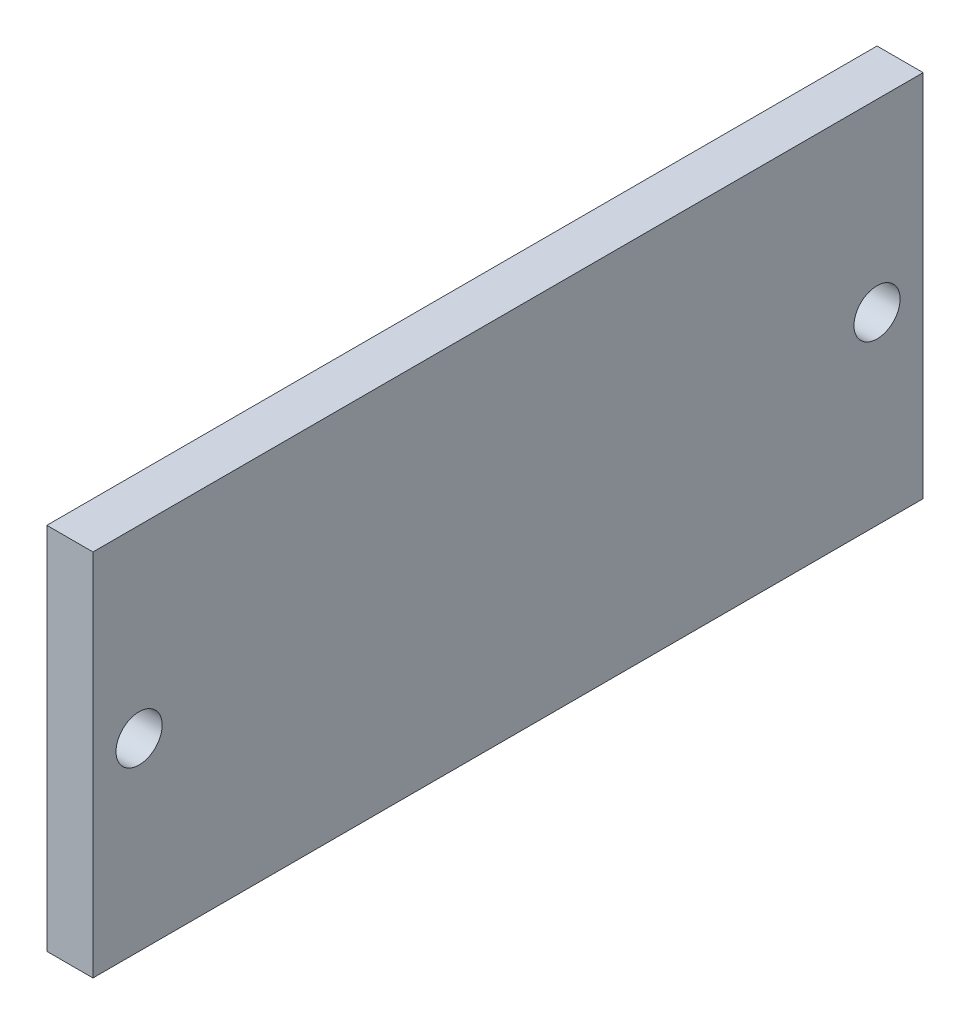
ISO-10303-21;
HEADER;
FILE_DESCRIPTION(('STEP AP214'),'2;1');
FILE_NAME('part.step','',(''),(''),'','','');
FILE_SCHEMA(('AUTOMOTIVE_DESIGN { 1 0 10303 214 1 1 1 1 }'));
ENDSEC;
DATA;
#1=APPLICATION_CONTEXT('core data for automotive mechanical design processes');
#2=APPLICATION_PROTOCOL_DEFINITION('international standard','automotive_design',2000,#1);
#3=PRODUCT_CONTEXT('',#1,'mechanical');
#4=PRODUCT('Part','Part','',(#3));
#5=PRODUCT_RELATED_PRODUCT_CATEGORY('part','',(#4));
#6=PRODUCT_DEFINITION_FORMATION('','',#4);
#7=PRODUCT_DEFINITION_CONTEXT('part definition',#1,'design');
#8=PRODUCT_DEFINITION('design','',#6,#7);
#9=PRODUCT_DEFINITION_SHAPE('','',#8);
#10=(LENGTH_UNIT() NAMED_UNIT(*) SI_UNIT(.MILLI.,.METRE.));
#11=(NAMED_UNIT(*) PLANE_ANGLE_UNIT() SI_UNIT($,.RADIAN.));
#12=(NAMED_UNIT(*) SI_UNIT($,.STERADIAN.) SOLID_ANGLE_UNIT());
#13=UNCERTAINTY_MEASURE_WITH_UNIT(LENGTH_MEASURE(1.E-05),#10,'distance_accuracy_value','');
#14=(GEOMETRIC_REPRESENTATION_CONTEXT(3) GLOBAL_UNCERTAINTY_ASSIGNED_CONTEXT((#13)) GLOBAL_UNIT_ASSIGNED_CONTEXT((#10,
#11,#12)) REPRESENTATION_CONTEXT('',''));
#15=CARTESIAN_POINT('',(0.,0.,0.));
#16=DIRECTION('',(0.,0.,1.));
#17=DIRECTION('',(1.,0.,0.));
#18=AXIS2_PLACEMENT_3D('',#15,#16,#17);
#19=CARTESIAN_POINT('',(12.7,0.,0.));
#20=DIRECTION('',(0.,0.,-1.));
#21=DIRECTION('',(0.,1.,0.));
#22=AXIS2_PLACEMENT_3D('',#19,#20,#21);
#23=PLANE('',#22);
#24=DIRECTION('',(0.,-1.,0.));
#25=VECTOR('',#24,1.);
#26=CARTESIAN_POINT('',(-12.7,0.,0.));
#27=LINE('',#26,#25);
#28=CARTESIAN_POINT('',(-12.7,203.2,1.11022302462516E-13));
#29=VERTEX_POINT('',#28);
#30=CARTESIAN_POINT('',(-12.7,0.,0.));
#31=VERTEX_POINT('',#30);
#32=EDGE_CURVE('E105',#29,#31,#27,.T.);
#33=ORIENTED_EDGE('',*,*,#32,.T.);
#34=DIRECTION('',(-1.,0.,0.));
#35=VECTOR('',#34,1.);
#36=CARTESIAN_POINT('',(12.7,0.,0.));
#37=LINE('',#36,#35);
#38=CARTESIAN_POINT('',(12.7,0.,0.));
#39=VERTEX_POINT('',#38);
#40=EDGE_CURVE('E11',#39,#31,#37,.T.);
#41=ORIENTED_EDGE('',*,*,#40,.F.);
#42=DIRECTION('',(0.,-1.,0.));
#43=VECTOR('',#42,1.);
#44=CARTESIAN_POINT('',(12.7,0.,0.));
#45=LINE('',#44,#43);
#46=CARTESIAN_POINT('',(12.7,203.2,1.11022302462516E-13));
#47=VERTEX_POINT('',#46);
#48=EDGE_CURVE('E92',#47,#39,#45,.T.);
#49=ORIENTED_EDGE('',*,*,#48,.F.);
#50=DIRECTION('',(-1.,0.,0.));
#51=VECTOR('',#50,1.);
#52=CARTESIAN_POINT('',(12.7,203.2,1.11022302462516E-13));
#53=LINE('',#52,#51);
#54=EDGE_CURVE('E101',#47,#29,#53,.T.);
#55=ORIENTED_EDGE('',*,*,#54,.T.);
#56=EDGE_LOOP('',(#33,#41,#49,#55));
#57=FACE_BOUND('',#56,.T.);
#58=ADVANCED_FACE('F39',(#57),#23,.F.);
#59=CARTESIAN_POINT('',(12.7,0.,0.));
#60=DIRECTION('',(0.,1.,0.));
#61=DIRECTION('',(0.,0.,1.));
#62=AXIS2_PLACEMENT_3D('',#59,#60,#61);
#63=PLANE('',#62);
#64=DIRECTION('',(0.,0.,-1.));
#65=VECTOR('',#64,1.);
#66=CARTESIAN_POINT('',(-12.7,0.,0.));
#67=LINE('',#66,#65);
#68=CARTESIAN_POINT('',(-12.7,0.,-457.2));
#69=VERTEX_POINT('',#68);
#70=EDGE_CURVE('E96',#31,#69,#67,.T.);
#71=ORIENTED_EDGE('',*,*,#70,.T.);
#72=DIRECTION('',(-1.,0.,0.));
#73=VECTOR('',#72,1.);
#74=CARTESIAN_POINT('',(12.7,0.,-457.2));
#75=LINE('',#74,#73);
#76=CARTESIAN_POINT('',(12.7,0.,-457.2));
#77=VERTEX_POINT('',#76);
#78=EDGE_CURVE('E48',#77,#69,#75,.T.);
#79=ORIENTED_EDGE('',*,*,#78,.F.);
#80=DIRECTION('',(0.,0.,-1.));
#81=VECTOR('',#80,1.);
#82=CARTESIAN_POINT('',(12.7,0.,0.));
#83=LINE('',#82,#81);
#84=EDGE_CURVE('E87',#39,#77,#83,.T.);
#85=ORIENTED_EDGE('',*,*,#84,.F.);
#86=ORIENTED_EDGE('',*,*,#40,.T.);
#87=EDGE_LOOP('',(#71,#79,#85,#86));
#88=FACE_BOUND('',#87,.T.);
#89=ADVANCED_FACE('F95',(#88),#63,.F.);
#90=CARTESIAN_POINT('',(12.7,0.,-457.2));
#91=DIRECTION('',(0.,0.,1.));
#92=DIRECTION('',(1.,0.,0.));
#93=AXIS2_PLACEMENT_3D('',#90,#91,#92);
#94=PLANE('',#93);
#95=DIRECTION('',(0.,1.,0.));
#96=VECTOR('',#95,1.);
#97=CARTESIAN_POINT('',(-12.7,0.,-457.2));
#98=LINE('',#97,#96);
#99=CARTESIAN_POINT('',(-12.7,203.2,-457.2));
#100=VERTEX_POINT('',#99);
#101=EDGE_CURVE('E74',#69,#100,#98,.T.);
#102=ORIENTED_EDGE('',*,*,#101,.T.);
#103=DIRECTION('',(-1.,0.,0.));
#104=VECTOR('',#103,1.);
#105=CARTESIAN_POINT('',(12.7,203.2,-457.2));
#106=LINE('',#105,#104);
#107=CARTESIAN_POINT('',(12.7,203.2,-457.2));
#108=VERTEX_POINT('',#107);
#109=EDGE_CURVE('E97',#108,#100,#106,.T.);
#110=ORIENTED_EDGE('',*,*,#109,.F.);
#111=DIRECTION('',(0.,1.,0.));
#112=VECTOR('',#111,1.);
#113=CARTESIAN_POINT('',(12.7,0.,-457.2));
#114=LINE('',#113,#112);
#115=EDGE_CURVE('E90',#77,#108,#114,.T.);
#116=ORIENTED_EDGE('',*,*,#115,.F.);
#117=ORIENTED_EDGE('',*,*,#78,.T.);
#118=EDGE_LOOP('',(#102,#110,#116,#117));
#119=FACE_BOUND('',#118,.T.);
#120=ADVANCED_FACE('F99',(#119),#94,.F.);
#121=CARTESIAN_POINT('',(12.7,203.2,1.11022302462516E-13));
#122=DIRECTION('',(0.,-1.,0.));
#123=DIRECTION('',(0.,0.,-1.));
#124=AXIS2_PLACEMENT_3D('',#121,#122,#123);
#125=PLANE('',#124);
#126=DIRECTION('',(0.,0.,1.));
#127=VECTOR('',#126,1.);
#128=CARTESIAN_POINT('',(-12.7,203.2,1.11022302462516E-13));
#129=LINE('',#128,#127);
#130=EDGE_CURVE('E80',#100,#29,#129,.T.);
#131=ORIENTED_EDGE('',*,*,#130,.T.);
#132=ORIENTED_EDGE('',*,*,#54,.F.);
#133=DIRECTION('',(0.,0.,1.));
#134=VECTOR('',#133,1.);
#135=CARTESIAN_POINT('',(12.7,203.2,1.11022302462516E-13));
#136=LINE('',#135,#134);
#137=EDGE_CURVE('E57',#108,#47,#136,.T.);
#138=ORIENTED_EDGE('',*,*,#137,.F.);
#139=ORIENTED_EDGE('',*,*,#109,.T.);
#140=EDGE_LOOP('',(#131,#132,#138,#139));
#141=FACE_BOUND('',#140,.T.);
#142=ADVANCED_FACE('F131',(#141),#125,.F.);
#143=CARTESIAN_POINT('',(12.7,0.,0.));
#144=DIRECTION('',(-1.,0.,0.));
#145=DIRECTION('',(0.,0.,1.));
#146=AXIS2_PLACEMENT_3D('',#143,#144,#145);
#147=PLANE('',#146);
#148=CARTESIAN_POINT('',(12.7,101.6,-25.4));
#149=DIRECTION('',(1.,0.,0.));
#150=DIRECTION('',(0.,0.,-1.));
#151=AXIS2_PLACEMENT_3D('',#148,#149,#150);
#152=CIRCLE('',#151,12.7);
#153=CARTESIAN_POINT('',(12.7,101.6,-38.1));
#154=VERTEX_POINT('',#153);
#155=EDGE_CURVE('E122',#154,#154,#152,.T.);
#156=ORIENTED_EDGE('',*,*,#155,.F.);
#157=EDGE_LOOP('',(#156));
#158=FACE_BOUND('',#157,.T.);
#159=CARTESIAN_POINT('',(12.7,101.6,-431.8));
#160=DIRECTION('',(-1.,0.,0.));
#161=DIRECTION('',(0.,0.,1.));
#162=AXIS2_PLACEMENT_3D('',#159,#160,#161);
#163=CIRCLE('',#162,12.7);
#164=CARTESIAN_POINT('',(12.7,101.6,-419.1));
#165=VERTEX_POINT('',#164);
#166=EDGE_CURVE('E114',#165,#165,#163,.T.);
#167=ORIENTED_EDGE('',*,*,#166,.T.);
#168=EDGE_LOOP('',(#167));
#169=FACE_BOUND('',#168,.T.);
#170=ORIENTED_EDGE('',*,*,#48,.T.);
#171=ORIENTED_EDGE('',*,*,#84,.T.);
#172=ORIENTED_EDGE('',*,*,#115,.T.);
#173=ORIENTED_EDGE('',*,*,#137,.T.);
#174=EDGE_LOOP('',(#170,#171,#172,#173));
#175=FACE_BOUND('',#174,.T.);
#176=ADVANCED_FACE('F88',(#158,#169,#175),#147,.F.);
#177=CARTESIAN_POINT('',(-12.7,0.,0.));
#178=DIRECTION('',(-1.,0.,0.));
#179=DIRECTION('',(0.,0.,1.));
#180=AXIS2_PLACEMENT_3D('',#177,#178,#179);
#181=PLANE('',#180);
#182=CARTESIAN_POINT('',(-12.7,101.6,-25.4));
#183=DIRECTION('',(-1.,0.,0.));
#184=DIRECTION('',(0.,0.,1.));
#185=AXIS2_PLACEMENT_3D('',#182,#183,#184);
#186=CIRCLE('',#185,12.7);
#187=CARTESIAN_POINT('',(-12.7,101.6,-12.7));
#188=VERTEX_POINT('',#187);
#189=EDGE_CURVE('E42',#188,#188,#186,.F.);
#190=ORIENTED_EDGE('',*,*,#189,.T.);
#191=EDGE_LOOP('',(#190));
#192=FACE_BOUND('',#191,.T.);
#193=CARTESIAN_POINT('',(-12.7,101.6,-431.8));
#194=DIRECTION('',(-1.,0.,0.));
#195=DIRECTION('',(0.,0.,1.));
#196=AXIS2_PLACEMENT_3D('',#193,#194,#195);
#197=CIRCLE('',#196,12.7);
#198=CARTESIAN_POINT('',(-12.7,101.6,-419.1));
#199=VERTEX_POINT('',#198);
#200=EDGE_CURVE('E108',#199,#199,#197,.T.);
#201=ORIENTED_EDGE('',*,*,#200,.F.);
#202=EDGE_LOOP('',(#201));
#203=FACE_BOUND('',#202,.T.);
#204=ORIENTED_EDGE('',*,*,#32,.F.);
#205=ORIENTED_EDGE('',*,*,#130,.F.);
#206=ORIENTED_EDGE('',*,*,#101,.F.);
#207=ORIENTED_EDGE('',*,*,#70,.F.);
#208=EDGE_LOOP('',(#204,#205,#206,#207));
#209=FACE_BOUND('',#208,.T.);
#210=ADVANCED_FACE('F130',(#192,#203,#209),#181,.T.);
#211=CARTESIAN_POINT('',(12.7,101.6,-431.8));
#212=DIRECTION('',(-1.,0.,0.));
#213=DIRECTION('',(0.,0.,1.));
#214=AXIS2_PLACEMENT_3D('',#211,#212,#213);
#215=CYLINDRICAL_SURFACE('',#214,12.7);
#216=ORIENTED_EDGE('',*,*,#200,.T.);
#217=EDGE_LOOP('',(#216));
#218=FACE_BOUND('',#217,.T.);
#219=ORIENTED_EDGE('',*,*,#166,.F.);
#220=EDGE_LOOP('',(#219));
#221=FACE_BOUND('',#220,.T.);
#222=ADVANCED_FACE('F137',(#218,#221),#215,.F.);
#223=CARTESIAN_POINT('',(12.7,101.6,-25.4));
#224=DIRECTION('',(-1.,0.,0.));
#225=DIRECTION('',(0.,0.,1.));
#226=AXIS2_PLACEMENT_3D('',#223,#224,#225);
#227=CYLINDRICAL_SURFACE('',#226,12.7);
#228=ORIENTED_EDGE('',*,*,#189,.F.);
#229=EDGE_LOOP('',(#228));
#230=FACE_BOUND('',#229,.T.);
#231=ORIENTED_EDGE('',*,*,#155,.T.);
#232=EDGE_LOOP('',(#231));
#233=FACE_BOUND('',#232,.T.);
#234=ADVANCED_FACE('F127',(#230,#233),#227,.F.);
#235=CLOSED_SHELL('',(#58,#89,#120,#142,#176,#210,#222,#234));
#236=MANIFOLD_SOLID_BREP('B2',#235);
#237=ADVANCED_BREP_SHAPE_REPRESENTATION('',(#18,#236),#14);
#238=SHAPE_DEFINITION_REPRESENTATION(#9,#237);
ENDSEC;
END-ISO-10303-21;
